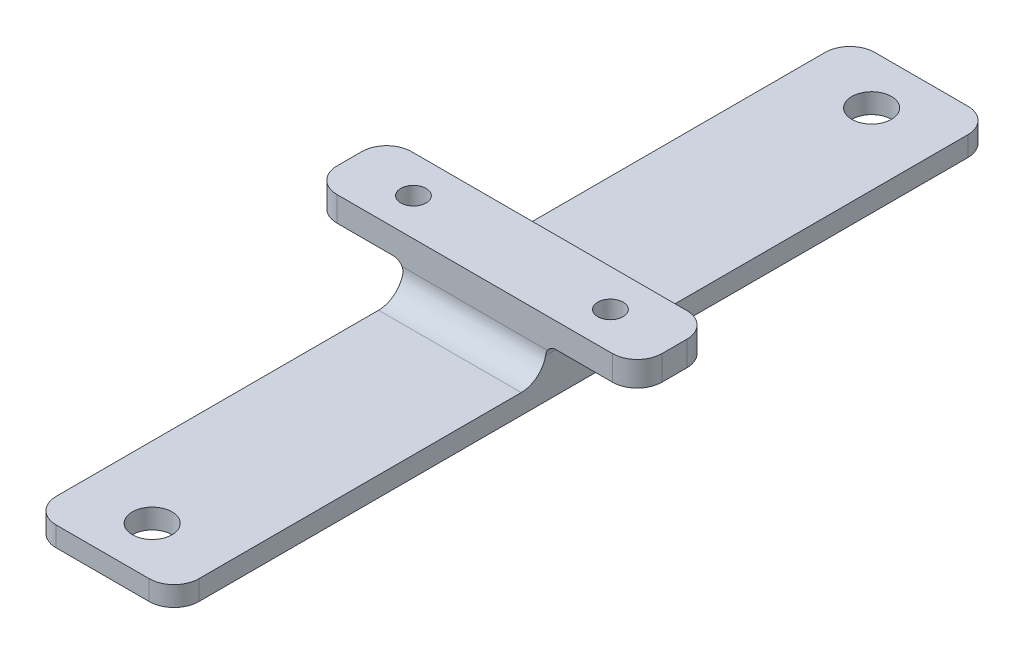
ISO-10303-21;
HEADER;
FILE_DESCRIPTION(('STEP AP214'),'2;1');
FILE_NAME('part.step','',(''),(''),'','','');
FILE_SCHEMA(('AUTOMOTIVE_DESIGN { 1 0 10303 214 1 1 1 1 }'));
ENDSEC;
DATA;
#1=APPLICATION_CONTEXT('core data for automotive mechanical design processes');
#2=APPLICATION_PROTOCOL_DEFINITION('international standard','automotive_design',2000,#1);
#3=PRODUCT_CONTEXT('',#1,'mechanical');
#4=PRODUCT('Part','Part','',(#3));
#5=PRODUCT_RELATED_PRODUCT_CATEGORY('part','',(#4));
#6=PRODUCT_DEFINITION_FORMATION('','',#4);
#7=PRODUCT_DEFINITION_CONTEXT('part definition',#1,'design');
#8=PRODUCT_DEFINITION('design','',#6,#7);
#9=PRODUCT_DEFINITION_SHAPE('','',#8);
#10=(LENGTH_UNIT() NAMED_UNIT(*) SI_UNIT(.MILLI.,.METRE.));
#11=(NAMED_UNIT(*) PLANE_ANGLE_UNIT() SI_UNIT($,.RADIAN.));
#12=(NAMED_UNIT(*) SI_UNIT($,.STERADIAN.) SOLID_ANGLE_UNIT());
#13=UNCERTAINTY_MEASURE_WITH_UNIT(LENGTH_MEASURE(1.E-05),#10,'distance_accuracy_value','');
#14=(GEOMETRIC_REPRESENTATION_CONTEXT(3) GLOBAL_UNCERTAINTY_ASSIGNED_CONTEXT((#13)) GLOBAL_UNIT_ASSIGNED_CONTEXT((#10,
#11,#12)) REPRESENTATION_CONTEXT('',''));
#15=CARTESIAN_POINT('',(0.,0.,0.));
#16=DIRECTION('',(0.,0.,1.));
#17=DIRECTION('',(1.,0.,0.));
#18=AXIS2_PLACEMENT_3D('',#15,#16,#17);
#19=CARTESIAN_POINT('',(0.,1406.6615884136,3.78943290488197E-12));
#20=DIRECTION('',(0.,1.,0.));
#21=DIRECTION('',(0.,0.,1.));
#22=AXIS2_PLACEMENT_3D('',#19,#20,#21);
#23=PLANE('',#22);
#24=DIRECTION('',(0.,0.,-1.));
#25=VECTOR('',#24,1.);
#26=CARTESIAN_POINT('',(912.371288414715,1406.6615884136,281.061912067685));
#27=LINE('',#26,#25);
#28=CARTESIAN_POINT('',(912.371288414715,1406.6615884136,276.061912067685));
#29=VERTEX_POINT('',#28);
#30=CARTESIAN_POINT('',(912.371288414715,1406.6615884136,211.09354746986));
#31=VERTEX_POINT('',#30);
#32=EDGE_CURVE('E443',#29,#31,#27,.T.);
#33=ORIENTED_EDGE('',*,*,#32,.T.);
#34=DIRECTION('',(1.,0.,0.));
#35=VECTOR('',#34,1.);
#36=CARTESIAN_POINT('',(4.07584203045429E-13,1406.6615884136,211.093547469862));
#37=LINE('',#36,#35);
#38=CARTESIAN_POINT('',(883.621288414715,1406.6615884136,211.09354746986));
#39=VERTEX_POINT('',#38);
#40=EDGE_CURVE('E233',#31,#39,#37,.F.);
#41=ORIENTED_EDGE('',*,*,#40,.T.);
#42=DIRECTION('',(0.,0.,1.));
#43=VECTOR('',#42,1.);
#44=CARTESIAN_POINT('',(883.621288414715,1406.6615884136,281.061912067685));
#45=LINE('',#44,#43);
#46=CARTESIAN_POINT('',(883.621288414715,1406.6615884136,276.061912067685));
#47=VERTEX_POINT('',#46);
#48=EDGE_CURVE('E448',#39,#47,#45,.T.);
#49=ORIENTED_EDGE('',*,*,#48,.T.);
#50=CARTESIAN_POINT('',(888.621288414715,1406.6615884136,276.061912067685));
#51=DIRECTION('',(0.,1.,0.));
#52=DIRECTION('',(0.,0.,1.));
#53=AXIS2_PLACEMENT_3D('',#50,#51,#52);
#54=CIRCLE('',#53,5.);
#55=CARTESIAN_POINT('',(888.621288414715,1406.6615884136,281.061912067685));
#56=VERTEX_POINT('',#55);
#57=EDGE_CURVE('E223',#47,#56,#54,.T.);
#58=ORIENTED_EDGE('',*,*,#57,.T.);
#59=DIRECTION('',(1.,0.,0.));
#60=VECTOR('',#59,1.);
#61=CARTESIAN_POINT('',(912.371288414715,1406.6615884136,281.061912067685));
#62=LINE('',#61,#60);
#63=CARTESIAN_POINT('',(907.371288414715,1406.6615884136,281.061912067685));
#64=VERTEX_POINT('',#63);
#65=EDGE_CURVE('E226',#56,#64,#62,.T.);
#66=ORIENTED_EDGE('',*,*,#65,.T.);
#67=CARTESIAN_POINT('',(907.371288414715,1406.6615884136,276.061912067685));
#68=DIRECTION('',(0.,1.,0.));
#69=DIRECTION('',(0.,0.,1.));
#70=AXIS2_PLACEMENT_3D('',#67,#68,#69);
#71=CIRCLE('',#70,5.);
#72=EDGE_CURVE('E231',#64,#29,#71,.T.);
#73=ORIENTED_EDGE('',*,*,#72,.T.);
#74=EDGE_LOOP('',(#33,#41,#49,#58,#66,#73));
#75=FACE_BOUND('',#74,.T.);
#76=CARTESIAN_POINT('',(897.996288414715,1406.6615884136,271.093547469829));
#77=DIRECTION('',(0.,1.,0.));
#78=DIRECTION('',(0.,0.,1.));
#79=AXIS2_PLACEMENT_3D('',#76,#77,#78);
#80=CIRCLE('',#79,3.99999999999999);
#81=CARTESIAN_POINT('',(897.996288414715,1406.6615884136,275.093547469829));
#82=VERTEX_POINT('',#81);
#83=EDGE_CURVE('E428',#82,#82,#80,.T.);
#84=ORIENTED_EDGE('',*,*,#83,.F.);
#85=EDGE_LOOP('',(#84));
#86=FACE_BOUND('',#85,.T.);
#87=ADVANCED_FACE('F33',(#75,#86),#23,.T.);
#88=CARTESIAN_POINT('',(883.621288414715,1406.6615884136,121.093547469829));
#89=VERTEX_POINT('',#88);
#90=CARTESIAN_POINT('',(883.621288414715,1406.6615884136,186.09354746986));
#91=VERTEX_POINT('',#90);
#92=EDGE_CURVE('E449',#89,#91,#45,.T.);
#93=ORIENTED_EDGE('',*,*,#92,.T.);
#94=DIRECTION('',(-1.,0.,0.));
#95=VECTOR('',#94,1.);
#96=CARTESIAN_POINT('',(0.,1406.6615884136,186.09354746986));
#97=LINE('',#96,#95);
#98=CARTESIAN_POINT('',(912.371288414715,1406.6615884136,186.09354746986));
#99=VERTEX_POINT('',#98);
#100=EDGE_CURVE('E245',#91,#99,#97,.F.);
#101=ORIENTED_EDGE('',*,*,#100,.T.);
#102=CARTESIAN_POINT('',(912.371288414715,1406.6615884136,121.093547469829));
#103=VERTEX_POINT('',#102);
#104=EDGE_CURVE('E440',#99,#103,#27,.T.);
#105=ORIENTED_EDGE('',*,*,#104,.T.);
#106=CARTESIAN_POINT('',(907.371288414715,1406.6615884136,121.093547469829));
#107=DIRECTION('',(0.,1.,0.));
#108=DIRECTION('',(0.,0.,1.));
#109=AXIS2_PLACEMENT_3D('',#106,#107,#108);
#110=CIRCLE('',#109,5.);
#111=CARTESIAN_POINT('',(907.371288414715,1406.6615884136,116.093547469829));
#112=VERTEX_POINT('',#111);
#113=EDGE_CURVE('E243',#103,#112,#110,.T.);
#114=ORIENTED_EDGE('',*,*,#113,.T.);
#115=DIRECTION('',(-1.,0.,0.));
#116=VECTOR('',#115,1.);
#117=CARTESIAN_POINT('',(912.371288414715,1406.6615884136,116.093547469829));
#118=LINE('',#117,#116);
#119=CARTESIAN_POINT('',(888.621288414715,1406.6615884136,116.093547469829));
#120=VERTEX_POINT('',#119);
#121=EDGE_CURVE('E445',#112,#120,#118,.T.);
#122=ORIENTED_EDGE('',*,*,#121,.T.);
#123=CARTESIAN_POINT('',(888.621288414715,1406.6615884136,121.093547469829));
#124=DIRECTION('',(0.,1.,0.));
#125=DIRECTION('',(0.,0.,1.));
#126=AXIS2_PLACEMENT_3D('',#123,#124,#125);
#127=CIRCLE('',#126,5.);
#128=EDGE_CURVE('E241',#120,#89,#127,.T.);
#129=ORIENTED_EDGE('',*,*,#128,.T.);
#130=EDGE_LOOP('',(#93,#101,#105,#114,#122,#129));
#131=FACE_BOUND('',#130,.T.);
#132=CARTESIAN_POINT('',(897.996288414715,1406.6615884136,126.093547469829));
#133=DIRECTION('',(0.,1.,0.));
#134=DIRECTION('',(0.,0.,1.));
#135=AXIS2_PLACEMENT_3D('',#132,#133,#134);
#136=CIRCLE('',#135,3.99999999999988);
#137=CARTESIAN_POINT('',(897.996288414715,1406.6615884136,130.093547469829));
#138=VERTEX_POINT('',#137);
#139=EDGE_CURVE('E434',#138,#138,#136,.T.);
#140=ORIENTED_EDGE('',*,*,#139,.F.);
#141=EDGE_LOOP('',(#140));
#142=FACE_BOUND('',#141,.T.);
#143=ADVANCED_FACE('F484',(#131,#142),#23,.T.);
#144=CARTESIAN_POINT('',(0.,1402.6615884136,3.77591714632132E-12));
#145=DIRECTION('',(0.,1.,0.));
#146=DIRECTION('',(0.,0.,1.));
#147=AXIS2_PLACEMENT_3D('',#144,#145,#146);
#148=PLANE('',#147);
#149=DIRECTION('',(0.,0.,-1.));
#150=VECTOR('',#149,1.);
#151=CARTESIAN_POINT('',(912.371288414715,1402.6615884136,281.061912067685));
#152=LINE('',#151,#150);
#153=CARTESIAN_POINT('',(912.371288414715,1402.6615884136,276.061912067685));
#154=VERTEX_POINT('',#153);
#155=CARTESIAN_POINT('',(912.371288414715,1402.6615884136,121.093547469829));
#156=VERTEX_POINT('',#155);
#157=EDGE_CURVE('E437',#154,#156,#152,.T.);
#158=ORIENTED_EDGE('',*,*,#157,.F.);
#159=CARTESIAN_POINT('',(907.371288414715,1402.6615884136,276.061912067685));
#160=DIRECTION('',(0.,1.,0.));
#161=DIRECTION('',(0.,0.,1.));
#162=AXIS2_PLACEMENT_3D('',#159,#160,#161);
#163=CIRCLE('',#162,5.);
#164=CARTESIAN_POINT('',(907.371288414715,1402.6615884136,281.061912067685));
#165=VERTEX_POINT('',#164);
#166=EDGE_CURVE('E258',#154,#165,#163,.F.);
#167=ORIENTED_EDGE('',*,*,#166,.T.);
#168=DIRECTION('',(1.,0.,0.));
#169=VECTOR('',#168,1.);
#170=CARTESIAN_POINT('',(912.371288414715,1402.6615884136,281.061912067685));
#171=LINE('',#170,#169);
#172=CARTESIAN_POINT('',(888.621288414715,1402.6615884136,281.061912067685));
#173=VERTEX_POINT('',#172);
#174=EDGE_CURVE('E444',#173,#165,#171,.T.);
#175=ORIENTED_EDGE('',*,*,#174,.F.);
#176=CARTESIAN_POINT('',(888.621288414715,1402.6615884136,276.061912067685));
#177=DIRECTION('',(0.,1.,0.));
#178=DIRECTION('',(0.,0.,1.));
#179=AXIS2_PLACEMENT_3D('',#176,#177,#178);
#180=CIRCLE('',#179,5.);
#181=CARTESIAN_POINT('',(883.621288414715,1402.6615884136,276.061912067685));
#182=VERTEX_POINT('',#181);
#183=EDGE_CURVE('E256',#173,#182,#180,.F.);
#184=ORIENTED_EDGE('',*,*,#183,.T.);
#185=DIRECTION('',(0.,0.,1.));
#186=VECTOR('',#185,1.);
#187=CARTESIAN_POINT('',(883.621288414715,1402.6615884136,281.061912067685));
#188=LINE('',#187,#186);
#189=CARTESIAN_POINT('',(883.621288414715,1402.6615884136,121.093547469829));
#190=VERTEX_POINT('',#189);
#191=EDGE_CURVE('E459',#190,#182,#188,.T.);
#192=ORIENTED_EDGE('',*,*,#191,.F.);
#193=CARTESIAN_POINT('',(888.621288414715,1402.6615884136,121.093547469829));
#194=DIRECTION('',(0.,1.,0.));
#195=DIRECTION('',(0.,0.,1.));
#196=AXIS2_PLACEMENT_3D('',#193,#194,#195);
#197=CIRCLE('',#196,5.);
#198=CARTESIAN_POINT('',(888.621288414715,1402.6615884136,116.093547469829));
#199=VERTEX_POINT('',#198);
#200=EDGE_CURVE('E252',#190,#199,#197,.F.);
#201=ORIENTED_EDGE('',*,*,#200,.T.);
#202=DIRECTION('',(-1.,0.,0.));
#203=VECTOR('',#202,1.);
#204=CARTESIAN_POINT('',(912.371288414715,1402.6615884136,116.093547469829));
#205=LINE('',#204,#203);
#206=CARTESIAN_POINT('',(907.371288414715,1402.6615884136,116.093547469829));
#207=VERTEX_POINT('',#206);
#208=EDGE_CURVE('E456',#207,#199,#205,.T.);
#209=ORIENTED_EDGE('',*,*,#208,.F.);
#210=CARTESIAN_POINT('',(907.371288414715,1402.6615884136,121.093547469829));
#211=DIRECTION('',(0.,1.,0.));
#212=DIRECTION('',(0.,0.,1.));
#213=AXIS2_PLACEMENT_3D('',#210,#211,#212);
#214=CIRCLE('',#213,5.);
#215=EDGE_CURVE('E254',#207,#156,#214,.F.);
#216=ORIENTED_EDGE('',*,*,#215,.T.);
#217=EDGE_LOOP('',(#158,#167,#175,#184,#192,#201,#209,#216));
#218=FACE_BOUND('',#217,.T.);
#219=CARTESIAN_POINT('',(897.996288414715,1402.6615884136,126.093547469829));
#220=DIRECTION('',(0.,1.,0.));
#221=DIRECTION('',(0.,0.,1.));
#222=AXIS2_PLACEMENT_3D('',#219,#220,#221);
#223=CIRCLE('',#222,3.99999999999988);
#224=CARTESIAN_POINT('',(897.996288414715,1402.6615884136,130.093547469829));
#225=VERTEX_POINT('',#224);
#226=EDGE_CURVE('E431',#225,#225,#223,.T.);
#227=ORIENTED_EDGE('',*,*,#226,.T.);
#228=EDGE_LOOP('',(#227));
#229=FACE_BOUND('',#228,.T.);
#230=CARTESIAN_POINT('',(897.996288414715,1402.6615884136,271.093547469829));
#231=DIRECTION('',(0.,1.,0.));
#232=DIRECTION('',(0.,0.,1.));
#233=AXIS2_PLACEMENT_3D('',#230,#231,#232);
#234=CIRCLE('',#233,3.99999999999999);
#235=CARTESIAN_POINT('',(897.996288414715,1402.6615884136,275.093547469829));
#236=VERTEX_POINT('',#235);
#237=EDGE_CURVE('E424',#236,#236,#234,.T.);
#238=ORIENTED_EDGE('',*,*,#237,.T.);
#239=EDGE_LOOP('',(#238));
#240=FACE_BOUND('',#239,.T.);
#241=ADVANCED_FACE('F545',(#218,#229,#240),#148,.F.);
#242=CARTESIAN_POINT('',(912.371288414715,1406.6615884136,281.061912067685));
#243=DIRECTION('',(-1.,0.,0.));
#244=DIRECTION('',(0.,-1.,0.));
#245=AXIS2_PLACEMENT_3D('',#242,#243,#244);
#246=PLANE('',#245);
#247=CARTESIAN_POINT('',(912.371288414715,1411.6615884136,186.09354746986));
#248=DIRECTION('',(-1.,0.,0.));
#249=DIRECTION('',(0.,-1.,0.));
#250=AXIS2_PLACEMENT_3D('',#247,#248,#249);
#251=CIRCLE('',#250,5.);
#252=CARTESIAN_POINT('',(912.371288414715,1410.6615884136,190.992526955427));
#253=VERTEX_POINT('',#252);
#254=EDGE_CURVE('E303',#99,#253,#251,.T.);
#255=ORIENTED_EDGE('',*,*,#254,.T.);
#256=DIRECTION('',(0.,0.,-1.));
#257=VECTOR('',#256,1.);
#258=CARTESIAN_POINT('',(912.371288414715,1410.6615884136,206.09354746986));
#259=LINE('',#258,#257);
#260=CARTESIAN_POINT('',(912.371288414715,1410.6615884136,206.194567984294));
#261=VERTEX_POINT('',#260);
#262=EDGE_CURVE('E313',#253,#261,#259,.F.);
#263=ORIENTED_EDGE('',*,*,#262,.T.);
#264=CARTESIAN_POINT('',(912.371288414715,1411.6615884136,211.09354746986));
#265=DIRECTION('',(-1.,0.,0.));
#266=DIRECTION('',(0.,-1.,0.));
#267=AXIS2_PLACEMENT_3D('',#264,#265,#266);
#268=CIRCLE('',#267,5.);
#269=EDGE_CURVE('E296',#261,#31,#268,.T.);
#270=ORIENTED_EDGE('',*,*,#269,.T.);
#271=ORIENTED_EDGE('',*,*,#32,.F.);
#272=DIRECTION('',(0.,-1.,0.));
#273=VECTOR('',#272,1.);
#274=CARTESIAN_POINT('',(912.371288414715,1406.6615884136,276.061912067685));
#275=LINE('',#274,#273);
#276=EDGE_CURVE('E249',#29,#154,#275,.T.);
#277=ORIENTED_EDGE('',*,*,#276,.T.);
#278=ORIENTED_EDGE('',*,*,#157,.T.);
#279=DIRECTION('',(0.,-1.,0.));
#280=VECTOR('',#279,1.);
#281=CARTESIAN_POINT('',(912.371288414715,1406.6615884136,121.093547469829));
#282=LINE('',#281,#280);
#283=EDGE_CURVE('E247',#156,#103,#282,.F.);
#284=ORIENTED_EDGE('',*,*,#283,.T.);
#285=ORIENTED_EDGE('',*,*,#104,.F.);
#286=EDGE_LOOP('',(#255,#263,#270,#271,#277,#278,#284,#285));
#287=FACE_BOUND('',#286,.T.);
#288=ADVANCED_FACE('F476',(#287),#246,.F.);
#289=CARTESIAN_POINT('',(912.371288414715,1406.6615884136,116.093547469829));
#290=DIRECTION('',(0.,0.,1.));
#291=DIRECTION('',(0.,-1.,0.));
#292=AXIS2_PLACEMENT_3D('',#289,#290,#291);
#293=PLANE('',#292);
#294=ORIENTED_EDGE('',*,*,#121,.F.);
#295=DIRECTION('',(0.,-1.,0.));
#296=VECTOR('',#295,1.);
#297=CARTESIAN_POINT('',(907.371288414715,1406.6615884136,116.093547469829));
#298=LINE('',#297,#296);
#299=EDGE_CURVE('E293',#112,#207,#298,.T.);
#300=ORIENTED_EDGE('',*,*,#299,.T.);
#301=ORIENTED_EDGE('',*,*,#208,.T.);
#302=DIRECTION('',(0.,-1.,0.));
#303=VECTOR('',#302,1.);
#304=CARTESIAN_POINT('',(888.621288414715,1406.6615884136,116.093547469829));
#305=LINE('',#304,#303);
#306=EDGE_CURVE('E291',#199,#120,#305,.F.);
#307=ORIENTED_EDGE('',*,*,#306,.T.);
#308=EDGE_LOOP('',(#294,#300,#301,#307));
#309=FACE_BOUND('',#308,.T.);
#310=ADVANCED_FACE('F493',(#309),#293,.F.);
#311=CARTESIAN_POINT('',(883.621288414715,1406.6615884136,281.061912067685));
#312=DIRECTION('',(1.,0.,0.));
#313=DIRECTION('',(0.,1.,0.));
#314=AXIS2_PLACEMENT_3D('',#311,#312,#313);
#315=PLANE('',#314);
#316=CARTESIAN_POINT('',(883.621288414715,1411.6615884136,211.09354746986));
#317=DIRECTION('',(1.,0.,0.));
#318=DIRECTION('',(0.,1.,0.));
#319=AXIS2_PLACEMENT_3D('',#316,#317,#318);
#320=CIRCLE('',#319,5.);
#321=CARTESIAN_POINT('',(883.621288414715,1410.6615884136,206.194567984294));
#322=VERTEX_POINT('',#321);
#323=EDGE_CURVE('E298',#39,#322,#320,.T.);
#324=ORIENTED_EDGE('',*,*,#323,.T.);
#325=DIRECTION('',(0.,0.,1.));
#326=VECTOR('',#325,1.);
#327=CARTESIAN_POINT('',(883.621288414715,1410.6615884136,191.09354746986));
#328=LINE('',#327,#326);
#329=CARTESIAN_POINT('',(883.621288414715,1410.6615884136,190.992526955427));
#330=VERTEX_POINT('',#329);
#331=EDGE_CURVE('E309',#322,#330,#328,.F.);
#332=ORIENTED_EDGE('',*,*,#331,.T.);
#333=CARTESIAN_POINT('',(883.621288414715,1411.6615884136,186.09354746986));
#334=DIRECTION('',(1.,0.,0.));
#335=DIRECTION('',(0.,1.,0.));
#336=AXIS2_PLACEMENT_3D('',#333,#334,#335);
#337=CIRCLE('',#336,5.);
#338=EDGE_CURVE('E301',#330,#91,#337,.T.);
#339=ORIENTED_EDGE('',*,*,#338,.T.);
#340=ORIENTED_EDGE('',*,*,#92,.F.);
#341=DIRECTION('',(0.,-1.,0.));
#342=VECTOR('',#341,1.);
#343=CARTESIAN_POINT('',(883.621288414715,1406.6615884136,121.093547469829));
#344=LINE('',#343,#342);
#345=EDGE_CURVE('E265',#89,#190,#344,.T.);
#346=ORIENTED_EDGE('',*,*,#345,.T.);
#347=ORIENTED_EDGE('',*,*,#191,.T.);
#348=DIRECTION('',(0.,-1.,0.));
#349=VECTOR('',#348,1.);
#350=CARTESIAN_POINT('',(883.621288414715,1406.6615884136,276.061912067685));
#351=LINE('',#350,#349);
#352=EDGE_CURVE('E216',#182,#47,#351,.F.);
#353=ORIENTED_EDGE('',*,*,#352,.T.);
#354=ORIENTED_EDGE('',*,*,#48,.F.);
#355=EDGE_LOOP('',(#324,#332,#339,#340,#346,#347,#353,#354));
#356=FACE_BOUND('',#355,.T.);
#357=ADVANCED_FACE('F498',(#356),#315,.F.);
#358=CARTESIAN_POINT('',(912.371288414715,1406.6615884136,281.061912067685));
#359=DIRECTION('',(0.,0.,-1.));
#360=DIRECTION('',(0.,1.,0.));
#361=AXIS2_PLACEMENT_3D('',#358,#359,#360);
#362=PLANE('',#361);
#363=ORIENTED_EDGE('',*,*,#174,.T.);
#364=DIRECTION('',(0.,-1.,0.));
#365=VECTOR('',#364,1.);
#366=CARTESIAN_POINT('',(907.371288414715,1406.6615884136,281.061912067685));
#367=LINE('',#366,#365);
#368=EDGE_CURVE('E263',#165,#64,#367,.F.);
#369=ORIENTED_EDGE('',*,*,#368,.T.);
#370=ORIENTED_EDGE('',*,*,#65,.F.);
#371=DIRECTION('',(0.,-1.,0.));
#372=VECTOR('',#371,1.);
#373=CARTESIAN_POINT('',(888.621288414715,1406.6615884136,281.061912067685));
#374=LINE('',#373,#372);
#375=EDGE_CURVE('E260',#56,#173,#374,.T.);
#376=ORIENTED_EDGE('',*,*,#375,.T.);
#377=EDGE_LOOP('',(#363,#369,#370,#376));
#378=FACE_BOUND('',#377,.T.);
#379=ADVANCED_FACE('F465',(#378),#362,.F.);
#380=CARTESIAN_POINT('',(897.996288414715,1406.6615884136,126.093547469829));
#381=DIRECTION('',(0.,-1.,0.));
#382=DIRECTION('',(0.,0.,-1.));
#383=AXIS2_PLACEMENT_3D('',#380,#381,#382);
#384=CYLINDRICAL_SURFACE('',#383,3.99999999999988);
#385=ORIENTED_EDGE('',*,*,#139,.T.);
#386=EDGE_LOOP('',(#385));
#387=FACE_BOUND('',#386,.T.);
#388=ORIENTED_EDGE('',*,*,#226,.F.);
#389=EDGE_LOOP('',(#388));
#390=FACE_BOUND('',#389,.T.);
#391=ADVANCED_FACE('F548',(#387,#390),#384,.F.);
#392=CARTESIAN_POINT('',(897.996288414715,1406.6615884136,271.093547469829));
#393=DIRECTION('',(0.,-1.,0.));
#394=DIRECTION('',(0.,0.,-1.));
#395=AXIS2_PLACEMENT_3D('',#392,#393,#394);
#396=CYLINDRICAL_SURFACE('',#395,3.99999999999999);
#397=ORIENTED_EDGE('',*,*,#83,.T.);
#398=EDGE_LOOP('',(#397));
#399=FACE_BOUND('',#398,.T.);
#400=ORIENTED_EDGE('',*,*,#237,.F.);
#401=EDGE_LOOP('',(#400));
#402=FACE_BOUND('',#401,.T.);
#403=ADVANCED_FACE('F582',(#399,#402),#396,.F.);
#404=CARTESIAN_POINT('',(883.621288414749,1412.6615884136,191.09354746986));
#405=DIRECTION('',(0.,0.,1.));
#406=DIRECTION('',(0.,-1.,0.));
#407=AXIS2_PLACEMENT_3D('',#404,#405,#406);
#408=PLANE('',#407);
#409=DIRECTION('',(-1.,0.,0.));
#410=VECTOR('',#409,1.);
#411=CARTESIAN_POINT('',(865.246288414732,1412.6615884136,191.09354746986));
#412=LINE('',#411,#410);
#413=CARTESIAN_POINT('',(925.746288414732,1412.6615884136,191.09354746986));
#414=VERTEX_POINT('',#413);
#415=CARTESIAN_POINT('',(914.371288414715,1412.6615884136,191.09354746986));
#416=VERTEX_POINT('',#415);
#417=EDGE_CURVE('E395',#414,#416,#412,.T.);
#418=ORIENTED_EDGE('',*,*,#417,.T.);
#419=CARTESIAN_POINT('',(914.371288414715,1410.6615884136,191.09354746986));
#420=DIRECTION('',(0.,0.,1.));
#421=DIRECTION('',(0.,-1.,0.));
#422=AXIS2_PLACEMENT_3D('',#419,#420,#421);
#423=CIRCLE('',#422,2.);
#424=CARTESIAN_POINT('',(912.639237607146,1411.6615884136,191.09354746986));
#425=VERTEX_POINT('',#424);
#426=EDGE_CURVE('E380',#416,#425,#423,.T.);
#427=ORIENTED_EDGE('',*,*,#426,.T.);
#428=DIRECTION('',(-1.,0.,0.));
#429=VECTOR('',#428,1.);
#430=CARTESIAN_POINT('',(883.621288414749,1411.6615884136,191.09354746986));
#431=LINE('',#430,#429);
#432=CARTESIAN_POINT('',(883.353339222284,1411.6615884136,191.09354746986));
#433=VERTEX_POINT('',#432);
#434=EDGE_CURVE('E56',#425,#433,#431,.T.);
#435=ORIENTED_EDGE('',*,*,#434,.T.);
#436=CARTESIAN_POINT('',(881.621288414715,1410.6615884136,191.09354746986));
#437=DIRECTION('',(0.,0.,1.));
#438=DIRECTION('',(0.,-1.,0.));
#439=AXIS2_PLACEMENT_3D('',#436,#437,#438);
#440=CIRCLE('',#439,2.);
#441=CARTESIAN_POINT('',(881.621288414715,1412.6615884136,191.09354746986));
#442=VERTEX_POINT('',#441);
#443=EDGE_CURVE('E505',#433,#442,#440,.T.);
#444=ORIENTED_EDGE('',*,*,#443,.T.);
#445=CARTESIAN_POINT('',(870.246288414732,1412.6615884136,191.09354746986));
#446=VERTEX_POINT('',#445);
#447=EDGE_CURVE('E401',#442,#446,#412,.T.);
#448=ORIENTED_EDGE('',*,*,#447,.T.);
#449=DIRECTION('',(0.,-1.,0.));
#450=VECTOR('',#449,1.);
#451=CARTESIAN_POINT('',(870.246288414732,1412.6615884136,191.09354746986));
#452=LINE('',#451,#450);
#453=CARTESIAN_POINT('',(870.246288414732,1417.66158841359,191.09354746986));
#454=VERTEX_POINT('',#453);
#455=EDGE_CURVE('E235',#446,#454,#452,.F.);
#456=ORIENTED_EDGE('',*,*,#455,.T.);
#457=DIRECTION('',(1.,0.,0.));
#458=VECTOR('',#457,1.);
#459=CARTESIAN_POINT('',(865.246288414732,1417.66158841359,191.09354746986));
#460=LINE('',#459,#458);
#461=CARTESIAN_POINT('',(925.746288414732,1417.66158841359,191.09354746986));
#462=VERTEX_POINT('',#461);
#463=EDGE_CURVE('E406',#454,#462,#460,.T.);
#464=ORIENTED_EDGE('',*,*,#463,.T.);
#465=DIRECTION('',(0.,-1.,0.));
#466=VECTOR('',#465,1.);
#467=CARTESIAN_POINT('',(925.746288414732,1412.6615884136,191.09354746986));
#468=LINE('',#467,#466);
#469=EDGE_CURVE('E237',#462,#414,#468,.T.);
#470=ORIENTED_EDGE('',*,*,#469,.T.);
#471=EDGE_LOOP('',(#418,#427,#435,#444,#448,#456,#464,#470));
#472=FACE_BOUND('',#471,.T.);
#473=ADVANCED_FACE('F397',(#472),#408,.F.);
#474=CARTESIAN_POINT('',(883.621288414749,1412.6615884136,206.09354746986));
#475=DIRECTION('',(0.,0.,-1.));
#476=DIRECTION('',(0.,1.,0.));
#477=AXIS2_PLACEMENT_3D('',#474,#475,#476);
#478=PLANE('',#477);
#479=DIRECTION('',(1.,0.,0.));
#480=VECTOR('',#479,1.);
#481=CARTESIAN_POINT('',(865.246288414732,1412.6615884136,206.09354746986));
#482=LINE('',#481,#480);
#483=CARTESIAN_POINT('',(870.246288414732,1412.6615884136,206.09354746986));
#484=VERTEX_POINT('',#483);
#485=CARTESIAN_POINT('',(881.621288414715,1412.6615884136,206.09354746986));
#486=VERTEX_POINT('',#485);
#487=EDGE_CURVE('E204',#484,#486,#482,.T.);
#488=ORIENTED_EDGE('',*,*,#487,.T.);
#489=CARTESIAN_POINT('',(881.621288414715,1410.6615884136,206.09354746986));
#490=DIRECTION('',(0.,0.,-1.));
#491=DIRECTION('',(0.,1.,0.));
#492=AXIS2_PLACEMENT_3D('',#489,#490,#491);
#493=CIRCLE('',#492,2.);
#494=CARTESIAN_POINT('',(883.353339222284,1411.6615884136,206.09354746986));
#495=VERTEX_POINT('',#494);
#496=EDGE_CURVE('E315',#486,#495,#493,.T.);
#497=ORIENTED_EDGE('',*,*,#496,.T.);
#498=DIRECTION('',(1.,0.,0.));
#499=VECTOR('',#498,1.);
#500=CARTESIAN_POINT('',(883.621288414749,1411.6615884136,206.09354746986));
#501=LINE('',#500,#499);
#502=CARTESIAN_POINT('',(912.639237607145,1411.6615884136,206.09354746986));
#503=VERTEX_POINT('',#502);
#504=EDGE_CURVE('E48',#495,#503,#501,.T.);
#505=ORIENTED_EDGE('',*,*,#504,.T.);
#506=CARTESIAN_POINT('',(914.371288414715,1410.6615884136,206.09354746986));
#507=DIRECTION('',(0.,0.,-1.));
#508=DIRECTION('',(0.,1.,0.));
#509=AXIS2_PLACEMENT_3D('',#506,#507,#508);
#510=CIRCLE('',#509,2.);
#511=CARTESIAN_POINT('',(914.371288414715,1412.6615884136,206.09354746986));
#512=VERTEX_POINT('',#511);
#513=EDGE_CURVE('E11',#503,#512,#510,.T.);
#514=ORIENTED_EDGE('',*,*,#513,.T.);
#515=CARTESIAN_POINT('',(925.746288414732,1412.6615884136,206.09354746986));
#516=VERTEX_POINT('',#515);
#517=EDGE_CURVE('E192',#512,#516,#482,.T.);
#518=ORIENTED_EDGE('',*,*,#517,.T.);
#519=DIRECTION('',(0.,-1.,0.));
#520=VECTOR('',#519,1.);
#521=CARTESIAN_POINT('',(925.746288414732,1412.6615884136,206.09354746986));
#522=LINE('',#521,#520);
#523=CARTESIAN_POINT('',(925.746288414732,1417.66158841359,206.09354746986));
#524=VERTEX_POINT('',#523);
#525=EDGE_CURVE('E198',#516,#524,#522,.F.);
#526=ORIENTED_EDGE('',*,*,#525,.T.);
#527=DIRECTION('',(-1.,0.,0.));
#528=VECTOR('',#527,1.);
#529=CARTESIAN_POINT('',(865.246288414732,1417.66158841359,206.09354746986));
#530=LINE('',#529,#528);
#531=CARTESIAN_POINT('',(870.246288414732,1417.66158841359,206.09354746986));
#532=VERTEX_POINT('',#531);
#533=EDGE_CURVE('E205',#524,#532,#530,.T.);
#534=ORIENTED_EDGE('',*,*,#533,.T.);
#535=DIRECTION('',(0.,-1.,0.));
#536=VECTOR('',#535,1.);
#537=CARTESIAN_POINT('',(870.246288414732,1412.6615884136,206.09354746986));
#538=LINE('',#537,#536);
#539=EDGE_CURVE('E221',#532,#484,#538,.T.);
#540=ORIENTED_EDGE('',*,*,#539,.T.);
#541=EDGE_LOOP('',(#488,#497,#505,#514,#518,#526,#534,#540));
#542=FACE_BOUND('',#541,.T.);
#543=ADVANCED_FACE('F195',(#542),#478,.F.);
#544=CARTESIAN_POINT('',(0.,1412.6615884136,0.));
#545=DIRECTION('',(0.,1.,0.));
#546=DIRECTION('',(0.,0.,1.));
#547=AXIS2_PLACEMENT_3D('',#544,#545,#546);
#548=PLANE('',#547);
#549=CARTESIAN_POINT('',(917.846288414732,1412.6615884136,198.59354746986));
#550=DIRECTION('',(0.,1.,0.));
#551=DIRECTION('',(0.,0.,1.));
#552=AXIS2_PLACEMENT_3D('',#549,#550,#551);
#553=CIRCLE('',#552,2.55000000000005);
#554=CARTESIAN_POINT('',(917.846288414732,1412.6615884136,201.14354746986));
#555=VERTEX_POINT('',#554);
#556=EDGE_CURVE('E411',#555,#555,#553,.T.);
#557=ORIENTED_EDGE('',*,*,#556,.T.);
#558=EDGE_LOOP('',(#557));
#559=FACE_BOUND('',#558,.T.);
#560=ORIENTED_EDGE('',*,*,#517,.F.);
#561=DIRECTION('',(0.,0.,-1.));
#562=VECTOR('',#561,1.);
#563=CARTESIAN_POINT('',(914.371288414715,1412.6615884136,191.09354746986));
#564=LINE('',#563,#562);
#565=EDGE_CURVE('E311',#512,#416,#564,.T.);
#566=ORIENTED_EDGE('',*,*,#565,.T.);
#567=ORIENTED_EDGE('',*,*,#417,.F.);
#568=CARTESIAN_POINT('',(925.746288414732,1412.6615884136,196.09354746986));
#569=DIRECTION('',(0.,1.,0.));
#570=DIRECTION('',(0.,0.,1.));
#571=AXIS2_PLACEMENT_3D('',#568,#569,#570);
#572=CIRCLE('',#571,5.);
#573=CARTESIAN_POINT('',(930.746288414732,1412.6615884136,196.09354746986));
#574=VERTEX_POINT('',#573);
#575=EDGE_CURVE('E215',#414,#574,#572,.F.);
#576=ORIENTED_EDGE('',*,*,#575,.T.);
#577=DIRECTION('',(0.,0.,-1.));
#578=VECTOR('',#577,1.);
#579=CARTESIAN_POINT('',(930.746288414732,1412.6615884136,191.09354746986));
#580=LINE('',#579,#578);
#581=CARTESIAN_POINT('',(930.746288414732,1412.6615884136,201.09354746986));
#582=VERTEX_POINT('',#581);
#583=EDGE_CURVE('E211',#582,#574,#580,.T.);
#584=ORIENTED_EDGE('',*,*,#583,.F.);
#585=CARTESIAN_POINT('',(925.746288414732,1412.6615884136,201.09354746986));
#586=DIRECTION('',(0.,1.,0.));
#587=DIRECTION('',(0.,0.,1.));
#588=AXIS2_PLACEMENT_3D('',#585,#586,#587);
#589=CIRCLE('',#588,5.);
#590=EDGE_CURVE('E208',#582,#516,#589,.F.);
#591=ORIENTED_EDGE('',*,*,#590,.T.);
#592=EDGE_LOOP('',(#560,#566,#567,#576,#584,#591));
#593=FACE_BOUND('',#592,.T.);
#594=ADVANCED_FACE('F209',(#559,#593),#548,.F.);
#595=CARTESIAN_POINT('',(878.146288414732,1412.6615884136,198.59354746986));
#596=DIRECTION('',(0.,1.,0.));
#597=DIRECTION('',(0.,0.,1.));
#598=AXIS2_PLACEMENT_3D('',#595,#596,#597);
#599=CIRCLE('',#598,2.55000000000004);
#600=CARTESIAN_POINT('',(878.146288414732,1412.6615884136,201.14354746986));
#601=VERTEX_POINT('',#600);
#602=EDGE_CURVE('E414',#601,#601,#599,.T.);
#603=ORIENTED_EDGE('',*,*,#602,.T.);
#604=EDGE_LOOP('',(#603));
#605=FACE_BOUND('',#604,.T.);
#606=ORIENTED_EDGE('',*,*,#447,.F.);
#607=DIRECTION('',(0.,0.,1.));
#608=VECTOR('',#607,1.);
#609=CARTESIAN_POINT('',(881.621288414715,1412.6615884136,206.09354746986));
#610=LINE('',#609,#608);
#611=EDGE_CURVE('E306',#442,#486,#610,.T.);
#612=ORIENTED_EDGE('',*,*,#611,.T.);
#613=ORIENTED_EDGE('',*,*,#487,.F.);
#614=CARTESIAN_POINT('',(870.246288414732,1412.6615884136,201.09354746986));
#615=DIRECTION('',(0.,1.,0.));
#616=DIRECTION('',(0.,0.,1.));
#617=AXIS2_PLACEMENT_3D('',#614,#615,#616);
#618=CIRCLE('',#617,5.);
#619=CARTESIAN_POINT('',(865.246288414732,1412.6615884136,201.09354746986));
#620=VERTEX_POINT('',#619);
#621=EDGE_CURVE('E284',#484,#620,#618,.F.);
#622=ORIENTED_EDGE('',*,*,#621,.T.);
#623=DIRECTION('',(0.,0.,1.));
#624=VECTOR('',#623,1.);
#625=CARTESIAN_POINT('',(865.246288414732,1412.6615884136,191.09354746986));
#626=LINE('',#625,#624);
#627=CARTESIAN_POINT('',(865.246288414732,1412.6615884136,196.09354746986));
#628=VERTEX_POINT('',#627);
#629=EDGE_CURVE('E404',#628,#620,#626,.T.);
#630=ORIENTED_EDGE('',*,*,#629,.F.);
#631=CARTESIAN_POINT('',(870.246288414732,1412.6615884136,196.09354746986));
#632=DIRECTION('',(0.,1.,0.));
#633=DIRECTION('',(0.,0.,1.));
#634=AXIS2_PLACEMENT_3D('',#631,#632,#633);
#635=CIRCLE('',#634,5.);
#636=EDGE_CURVE('E281',#628,#446,#635,.F.);
#637=ORIENTED_EDGE('',*,*,#636,.T.);
#638=EDGE_LOOP('',(#606,#612,#613,#622,#630,#637));
#639=FACE_BOUND('',#638,.T.);
#640=ADVANCED_FACE('F508',(#605,#639),#548,.F.);
#641=CARTESIAN_POINT('',(930.746288414732,1484.85719838924,191.09354746986));
#642=DIRECTION('',(-1.,0.,0.));
#643=DIRECTION('',(0.,0.,1.));
#644=AXIS2_PLACEMENT_3D('',#641,#642,#643);
#645=PLANE('',#644);
#646=ORIENTED_EDGE('',*,*,#583,.T.);
#647=DIRECTION('',(0.,-1.,0.));
#648=VECTOR('',#647,1.);
#649=CARTESIAN_POINT('',(930.746288414732,1484.85719838924,196.09354746986));
#650=LINE('',#649,#648);
#651=CARTESIAN_POINT('',(930.746288414732,1417.66158841359,196.09354746986));
#652=VERTEX_POINT('',#651);
#653=EDGE_CURVE('E272',#574,#652,#650,.F.);
#654=ORIENTED_EDGE('',*,*,#653,.T.);
#655=DIRECTION('',(0.,0.,1.));
#656=VECTOR('',#655,1.);
#657=CARTESIAN_POINT('',(930.746288414732,1417.66158841359,191.093547469859));
#658=LINE('',#657,#656);
#659=CARTESIAN_POINT('',(930.746288414732,1417.66158841359,201.09354746986));
#660=VERTEX_POINT('',#659);
#661=EDGE_CURVE('E410',#652,#660,#658,.T.);
#662=ORIENTED_EDGE('',*,*,#661,.T.);
#663=DIRECTION('',(0.,-1.,0.));
#664=VECTOR('',#663,1.);
#665=CARTESIAN_POINT('',(930.746288414732,1484.85719838924,201.09354746986));
#666=LINE('',#665,#664);
#667=EDGE_CURVE('E270',#660,#582,#666,.T.);
#668=ORIENTED_EDGE('',*,*,#667,.T.);
#669=EDGE_LOOP('',(#646,#654,#662,#668));
#670=FACE_BOUND('',#669,.T.);
#671=ADVANCED_FACE('F528',(#670),#645,.F.);
#672=CARTESIAN_POINT('',(865.246288414732,1484.85719838924,191.09354746986));
#673=DIRECTION('',(1.,0.,0.));
#674=DIRECTION('',(0.,0.,-1.));
#675=AXIS2_PLACEMENT_3D('',#672,#673,#674);
#676=PLANE('',#675);
#677=ORIENTED_EDGE('',*,*,#629,.T.);
#678=DIRECTION('',(0.,-1.,0.));
#679=VECTOR('',#678,1.);
#680=CARTESIAN_POINT('',(865.246288414732,1484.85719838924,201.09354746986));
#681=LINE('',#680,#679);
#682=CARTESIAN_POINT('',(865.246288414732,1417.66158841359,201.09354746986));
#683=VERTEX_POINT('',#682);
#684=EDGE_CURVE('E289',#620,#683,#681,.F.);
#685=ORIENTED_EDGE('',*,*,#684,.T.);
#686=DIRECTION('',(0.,0.,-1.));
#687=VECTOR('',#686,1.);
#688=CARTESIAN_POINT('',(865.246288414732,1417.66158841359,191.093547469859));
#689=LINE('',#688,#687);
#690=CARTESIAN_POINT('',(865.246288414732,1417.66158841359,196.09354746986));
#691=VERTEX_POINT('',#690);
#692=EDGE_CURVE('E400',#683,#691,#689,.T.);
#693=ORIENTED_EDGE('',*,*,#692,.T.);
#694=DIRECTION('',(0.,-1.,0.));
#695=VECTOR('',#694,1.);
#696=CARTESIAN_POINT('',(865.246288414732,1484.85719838924,196.09354746986));
#697=LINE('',#696,#695);
#698=EDGE_CURVE('E286',#691,#628,#697,.T.);
#699=ORIENTED_EDGE('',*,*,#698,.T.);
#700=EDGE_LOOP('',(#677,#685,#693,#699));
#701=FACE_BOUND('',#700,.T.);
#702=ADVANCED_FACE('F516',(#701),#676,.F.);
#703=CARTESIAN_POINT('',(917.846288414732,1484.85719838924,198.59354746986));
#704=DIRECTION('',(0.,-1.,0.));
#705=DIRECTION('',(0.,0.,-1.));
#706=AXIS2_PLACEMENT_3D('',#703,#704,#705);
#707=CYLINDRICAL_SURFACE('',#706,2.55000000000005);
#708=CARTESIAN_POINT('',(917.846288414732,1417.66158841359,198.59354746986));
#709=DIRECTION('',(0.,-1.,0.));
#710=DIRECTION('',(0.,0.,-1.));
#711=AXIS2_PLACEMENT_3D('',#708,#709,#710);
#712=CIRCLE('',#711,2.55000000000005);
#713=CARTESIAN_POINT('',(917.846288414732,1417.66158841359,196.04354746986));
#714=VERTEX_POINT('',#713);
#715=EDGE_CURVE('E421',#714,#714,#712,.T.);
#716=ORIENTED_EDGE('',*,*,#715,.F.);
#717=EDGE_LOOP('',(#716));
#718=FACE_BOUND('',#717,.T.);
#719=ORIENTED_EDGE('',*,*,#556,.F.);
#720=EDGE_LOOP('',(#719));
#721=FACE_BOUND('',#720,.T.);
#722=ADVANCED_FACE('F535',(#718,#721),#707,.F.);
#723=CARTESIAN_POINT('',(878.146288414732,1484.85719838924,198.59354746986));
#724=DIRECTION('',(0.,-1.,0.));
#725=DIRECTION('',(0.,0.,-1.));
#726=AXIS2_PLACEMENT_3D('',#723,#724,#725);
#727=CYLINDRICAL_SURFACE('',#726,2.55000000000004);
#728=CARTESIAN_POINT('',(878.146288414732,1417.66158841359,198.59354746986));
#729=DIRECTION('',(0.,-1.,0.));
#730=DIRECTION('',(0.,0.,-1.));
#731=AXIS2_PLACEMENT_3D('',#728,#729,#730);
#732=CIRCLE('',#731,2.55000000000004);
#733=CARTESIAN_POINT('',(878.146288414732,1417.66158841359,196.04354746986));
#734=VERTEX_POINT('',#733);
#735=EDGE_CURVE('E425',#734,#734,#732,.T.);
#736=ORIENTED_EDGE('',*,*,#735,.F.);
#737=EDGE_LOOP('',(#736));
#738=FACE_BOUND('',#737,.T.);
#739=ORIENTED_EDGE('',*,*,#602,.F.);
#740=EDGE_LOOP('',(#739));
#741=FACE_BOUND('',#740,.T.);
#742=ADVANCED_FACE('F680',(#738,#741),#727,.F.);
#743=CARTESIAN_POINT('',(927.746288414732,1417.66158841359,168.84354746986));
#744=DIRECTION('',(0.,-1.,0.));
#745=DIRECTION('',(0.,0.,1.));
#746=AXIS2_PLACEMENT_3D('',#743,#744,#745);
#747=PLANE('',#746);
#748=ORIENTED_EDGE('',*,*,#735,.T.);
#749=EDGE_LOOP('',(#748));
#750=FACE_BOUND('',#749,.T.);
#751=ORIENTED_EDGE('',*,*,#715,.T.);
#752=EDGE_LOOP('',(#751));
#753=FACE_BOUND('',#752,.T.);
#754=ORIENTED_EDGE('',*,*,#661,.F.);
#755=CARTESIAN_POINT('',(925.746288414732,1417.66158841359,196.09354746986));
#756=DIRECTION('',(0.,-1.,0.));
#757=DIRECTION('',(0.,0.,-1.));
#758=AXIS2_PLACEMENT_3D('',#755,#756,#757);
#759=CIRCLE('',#758,5.);
#760=EDGE_CURVE('E279',#652,#462,#759,.F.);
#761=ORIENTED_EDGE('',*,*,#760,.T.);
#762=ORIENTED_EDGE('',*,*,#463,.F.);
#763=CARTESIAN_POINT('',(870.246288414732,1417.66158841359,196.09354746986));
#764=DIRECTION('',(0.,-1.,0.));
#765=DIRECTION('',(0.,0.,-1.));
#766=AXIS2_PLACEMENT_3D('',#763,#764,#765);
#767=CIRCLE('',#766,5.);
#768=EDGE_CURVE('E274',#454,#691,#767,.F.);
#769=ORIENTED_EDGE('',*,*,#768,.T.);
#770=ORIENTED_EDGE('',*,*,#692,.F.);
#771=CARTESIAN_POINT('',(870.246288414732,1417.66158841359,201.09354746986));
#772=DIRECTION('',(0.,-1.,0.));
#773=DIRECTION('',(0.,0.,-1.));
#774=AXIS2_PLACEMENT_3D('',#771,#772,#773);
#775=CIRCLE('',#774,5.);
#776=EDGE_CURVE('E276',#683,#532,#775,.F.);
#777=ORIENTED_EDGE('',*,*,#776,.T.);
#778=ORIENTED_EDGE('',*,*,#533,.F.);
#779=CARTESIAN_POINT('',(925.746288414732,1417.66158841359,201.09354746986));
#780=DIRECTION('',(0.,-1.,0.));
#781=DIRECTION('',(0.,0.,-1.));
#782=AXIS2_PLACEMENT_3D('',#779,#780,#781);
#783=CIRCLE('',#782,5.);
#784=EDGE_CURVE('E220',#524,#660,#783,.F.);
#785=ORIENTED_EDGE('',*,*,#784,.T.);
#786=EDGE_LOOP('',(#754,#761,#762,#769,#770,#777,#778,#785));
#787=FACE_BOUND('',#786,.T.);
#788=ADVANCED_FACE('F522',(#750,#753,#787),#747,.F.);
#789=CARTESIAN_POINT('',(883.621288414749,1411.6615884136,211.09354746986));
#790=DIRECTION('',(1.,0.,0.));
#791=DIRECTION('',(0.,0.,-1.));
#792=AXIS2_PLACEMENT_3D('',#789,#790,#791);
#793=CYLINDRICAL_SURFACE('',#792,5.);
#794=ORIENTED_EDGE('',*,*,#323,.F.);
#795=ORIENTED_EDGE('',*,*,#40,.F.);
#796=ORIENTED_EDGE('',*,*,#269,.F.);
#797=CARTESIAN_POINT('',(912.371288414715,1410.6615884136,206.194567984294));
#798=CARTESIAN_POINT('',(912.371280531409,1410.71422515218,206.183815349689));
#799=CARTESIAN_POINT('',(912.37336624862,1410.76704218116,206.173925804239));
#800=CARTESIAN_POINT('',(912.381753334253,1410.87265431827,206.155892940992));
#801=CARTESIAN_POINT('',(912.388055876385,1410.92544941621,206.147750110209));
#802=CARTESIAN_POINT('',(912.404710600282,1411.0293915778,206.133404272448));
#803=CARTESIAN_POINT('',(912.414965929791,1411.08054854953,206.127160821357));
#804=CARTESIAN_POINT('',(912.439488992174,1411.18204726404,206.116334774437));
#805=CARTESIAN_POINT('',(912.453755283702,1411.23238929282,206.111751583343));
#806=CARTESIAN_POINT('',(912.491319098429,1411.34746510597,206.102996199881));
#807=CARTESIAN_POINT('',(912.516045681105,1411.41178126333,206.09939979869));
#808=CARTESIAN_POINT('',(912.572455767452,1411.53858180689,206.094646938712));
#809=CARTESIAN_POINT('',(912.60424117356,1411.60102234207,206.093529167489));
#810=CARTESIAN_POINT('',(912.639237607145,1411.6615884136,206.09354746986));
#811=B_SPLINE_CURVE_WITH_KNOTS('',3,(#797,#798,#799,#800,#801,#802,#803,#804,#805,#806,#807,
#808,#809,#810),.UNSPECIFIED.,.F.,.F.,(4,2,2,2,2,2,4),(0.,0.161129546235695,0.322303959871429,
0.479757380260597,0.63715429167603,0.843727012361311,1.05350196800383),.UNSPECIFIED.);
#812=EDGE_CURVE('E42',#261,#503,#811,.T.);
#813=ORIENTED_EDGE('',*,*,#812,.T.);
#814=ORIENTED_EDGE('',*,*,#504,.F.);
#815=CARTESIAN_POINT('',(883.353339222284,1411.6615884136,206.09354746986));
#816=CARTESIAN_POINT('',(883.380208022684,1411.61506543097,206.093541839263));
#817=CARTESIAN_POINT('',(883.40519076234,1411.56744991088,206.094196568199));
#818=CARTESIAN_POINT('',(883.451240389664,1411.47038633757,206.096970163061));
#819=CARTESIAN_POINT('',(883.472306154377,1411.42093776367,206.09908944804));
#820=CARTESIAN_POINT('',(883.509923015539,1411.32174666812,206.104868218497));
#821=CARTESIAN_POINT('',(883.526567156136,1411.27203732014,206.108490996223));
#822=CARTESIAN_POINT('',(883.555869029602,1411.17162160108,206.117356619431));
#823=CARTESIAN_POINT('',(883.568528207167,1411.12091559842,206.122598876423));
#824=CARTESIAN_POINT('',(883.593134173729,1411.00290444923,206.136666924609));
#825=CARTESIAN_POINT('',(883.60362268006,1410.93536280201,206.146100610168));
#826=CARTESIAN_POINT('',(883.617766897079,1410.7989722294,206.168021887201));
#827=CARTESIAN_POINT('',(883.621314164844,1410.7301192697,206.180554553455));
#828=CARTESIAN_POINT('',(883.621288414715,1410.6615884136,206.194567984294));
#829=B_SPLINE_CURVE_WITH_KNOTS('',3,(#815,#816,#817,#818,#819,#820,#821,#822,#823,#824,#825,
#826,#827,#828),.UNSPECIFIED.,.F.,.F.,(4,2,2,2,2,2,4),(0.,0.161130223110396,0.322306569509367,
0.479759914604238,0.637156111138466,0.843727913026811,1.05350200284361),.UNSPECIFIED.);
#830=EDGE_CURVE('E317',#495,#322,#829,.T.);
#831=ORIENTED_EDGE('',*,*,#830,.T.);
#832=EDGE_LOOP('',(#794,#795,#796,#813,#814,#831));
#833=FACE_BOUND('',#832,.T.);
#834=ADVANCED_FACE('F331',(#833),#793,.F.);
#835=CARTESIAN_POINT('',(883.621288414749,1411.6615884136,186.09354746986));
#836=DIRECTION('',(-1.,0.,0.));
#837=DIRECTION('',(0.,0.,1.));
#838=AXIS2_PLACEMENT_3D('',#835,#836,#837);
#839=CYLINDRICAL_SURFACE('',#838,5.);
#840=ORIENTED_EDGE('',*,*,#254,.F.);
#841=ORIENTED_EDGE('',*,*,#100,.F.);
#842=ORIENTED_EDGE('',*,*,#338,.F.);
#843=CARTESIAN_POINT('',(883.621288414715,1410.6615884136,190.992526955427));
#844=CARTESIAN_POINT('',(883.62129629802,1410.71422515218,191.003279590031));
#845=CARTESIAN_POINT('',(883.61921058081,1410.76704218116,191.013169135482));
#846=CARTESIAN_POINT('',(883.610823495176,1410.87265431827,191.031201998729));
#847=CARTESIAN_POINT('',(883.604520953045,1410.92544941621,191.039344829512));
#848=CARTESIAN_POINT('',(883.587866229147,1411.0293915778,191.053690667272));
#849=CARTESIAN_POINT('',(883.577610899638,1411.08054854953,191.059934118363));
#850=CARTESIAN_POINT('',(883.553087837255,1411.18204726404,191.070760165283));
#851=CARTESIAN_POINT('',(883.538821545727,1411.23238929282,191.075343356377));
#852=CARTESIAN_POINT('',(883.501257731,1411.34746510597,191.084098739839));
#853=CARTESIAN_POINT('',(883.476531148324,1411.41178126333,191.087695141031));
#854=CARTESIAN_POINT('',(883.420121061977,1411.53858180689,191.092448001008));
#855=CARTESIAN_POINT('',(883.388335655869,1411.60102234207,191.093565772232));
#856=CARTESIAN_POINT('',(883.353339222284,1411.6615884136,191.09354746986));
#857=B_SPLINE_CURVE_WITH_KNOTS('',3,(#843,#844,#845,#846,#847,#848,#849,#850,#851,#852,#853,
#854,#855,#856),.UNSPECIFIED.,.F.,.F.,(4,2,2,2,2,2,4),(0.,0.161129546235689,0.322303959871428,
0.479757380260596,0.637154291676032,0.843727012361311,1.05350196800408),.UNSPECIFIED.);
#858=EDGE_CURVE('E324',#330,#433,#857,.T.);
#859=ORIENTED_EDGE('',*,*,#858,.T.);
#860=ORIENTED_EDGE('',*,*,#434,.F.);
#861=CARTESIAN_POINT('',(912.639237607146,1411.6615884136,191.09354746986));
#862=CARTESIAN_POINT('',(912.612368806746,1411.61506543097,191.093553100458));
#863=CARTESIAN_POINT('',(912.587386067089,1411.56744991089,191.092898371521));
#864=CARTESIAN_POINT('',(912.541336439766,1411.47038633757,191.090124776659));
#865=CARTESIAN_POINT('',(912.520270675053,1411.42093776367,191.088005491681));
#866=CARTESIAN_POINT('',(912.48265381389,1411.32174666812,191.082226721223));
#867=CARTESIAN_POINT('',(912.466009673293,1411.27203732014,191.078603943497));
#868=CARTESIAN_POINT('',(912.436707799827,1411.17162160108,191.069738320289));
#869=CARTESIAN_POINT('',(912.424048622262,1411.12091559842,191.064496063297));
#870=CARTESIAN_POINT('',(912.3994426557,1411.00290444923,191.050428015111));
#871=CARTESIAN_POINT('',(912.388954149369,1410.93536280201,191.040994329552));
#872=CARTESIAN_POINT('',(912.37480993235,1410.7989722294,191.019073052519));
#873=CARTESIAN_POINT('',(912.371262664585,1410.7301192697,191.006540386265));
#874=CARTESIAN_POINT('',(912.371288414715,1410.6615884136,190.992526955426));
#875=B_SPLINE_CURVE_WITH_KNOTS('',3,(#861,#862,#863,#864,#865,#866,#867,#868,#869,#870,#871,
#872,#873,#874),.UNSPECIFIED.,.F.,.F.,(4,2,2,2,2,2,4),(0.,0.161130223110396,0.322306569509163,
0.47975991460407,0.637156111138538,0.843727913027108,1.05350200284391),.UNSPECIFIED.);
#876=EDGE_CURVE('E374',#425,#253,#875,.T.);
#877=ORIENTED_EDGE('',*,*,#876,.T.);
#878=EDGE_LOOP('',(#840,#841,#842,#859,#860,#877));
#879=FACE_BOUND('',#878,.T.);
#880=ADVANCED_FACE('F368',(#879),#839,.F.);
#881=CARTESIAN_POINT('',(907.371288414715,1406.6615884136,276.061912067685));
#882=DIRECTION('',(0.,-1.,0.));
#883=DIRECTION('',(0.,0.,-1.));
#884=AXIS2_PLACEMENT_3D('',#881,#882,#883);
#885=CYLINDRICAL_SURFACE('',#884,5.);
#886=ORIENTED_EDGE('',*,*,#72,.F.);
#887=ORIENTED_EDGE('',*,*,#368,.F.);
#888=ORIENTED_EDGE('',*,*,#166,.F.);
#889=ORIENTED_EDGE('',*,*,#276,.F.);
#890=EDGE_LOOP('',(#886,#887,#888,#889));
#891=FACE_BOUND('',#890,.T.);
#892=ADVANCED_FACE('F365',(#891),#885,.T.);
#893=CARTESIAN_POINT('',(888.621288414715,1406.6615884136,276.061912067685));
#894=DIRECTION('',(0.,-1.,0.));
#895=DIRECTION('',(0.,0.,-1.));
#896=AXIS2_PLACEMENT_3D('',#893,#894,#895);
#897=CYLINDRICAL_SURFACE('',#896,5.);
#898=ORIENTED_EDGE('',*,*,#57,.F.);
#899=ORIENTED_EDGE('',*,*,#352,.F.);
#900=ORIENTED_EDGE('',*,*,#183,.F.);
#901=ORIENTED_EDGE('',*,*,#375,.F.);
#902=EDGE_LOOP('',(#898,#899,#900,#901));
#903=FACE_BOUND('',#902,.T.);
#904=ADVANCED_FACE('F361',(#903),#897,.T.);
#905=CARTESIAN_POINT('',(925.746288414732,1412.6615884136,196.09354746986));
#906=DIRECTION('',(0.,-1.,0.));
#907=DIRECTION('',(0.,0.,-1.));
#908=AXIS2_PLACEMENT_3D('',#905,#906,#907);
#909=CYLINDRICAL_SURFACE('',#908,5.);
#910=ORIENTED_EDGE('',*,*,#760,.F.);
#911=ORIENTED_EDGE('',*,*,#653,.F.);
#912=ORIENTED_EDGE('',*,*,#575,.F.);
#913=ORIENTED_EDGE('',*,*,#469,.F.);
#914=EDGE_LOOP('',(#910,#911,#912,#913));
#915=FACE_BOUND('',#914,.T.);
#916=ADVANCED_FACE('F358',(#915),#909,.T.);
#917=CARTESIAN_POINT('',(925.746288414732,1484.85719838924,201.09354746986));
#918=DIRECTION('',(0.,-1.,0.));
#919=DIRECTION('',(0.,0.,-1.));
#920=AXIS2_PLACEMENT_3D('',#917,#918,#919);
#921=CYLINDRICAL_SURFACE('',#920,5.);
#922=ORIENTED_EDGE('',*,*,#784,.F.);
#923=ORIENTED_EDGE('',*,*,#525,.F.);
#924=ORIENTED_EDGE('',*,*,#590,.F.);
#925=ORIENTED_EDGE('',*,*,#667,.F.);
#926=EDGE_LOOP('',(#922,#923,#924,#925));
#927=FACE_BOUND('',#926,.T.);
#928=ADVANCED_FACE('F219',(#927),#921,.T.);
#929=CARTESIAN_POINT('',(870.246288414732,1412.6615884136,201.09354746986));
#930=DIRECTION('',(0.,-1.,0.));
#931=DIRECTION('',(0.,0.,-1.));
#932=AXIS2_PLACEMENT_3D('',#929,#930,#931);
#933=CYLINDRICAL_SURFACE('',#932,5.);
#934=ORIENTED_EDGE('',*,*,#776,.F.);
#935=ORIENTED_EDGE('',*,*,#684,.F.);
#936=ORIENTED_EDGE('',*,*,#621,.F.);
#937=ORIENTED_EDGE('',*,*,#539,.F.);
#938=EDGE_LOOP('',(#934,#935,#936,#937));
#939=FACE_BOUND('',#938,.T.);
#940=ADVANCED_FACE('F351',(#939),#933,.T.);
#941=CARTESIAN_POINT('',(870.246288414732,1484.85719838924,196.09354746986));
#942=DIRECTION('',(0.,-1.,0.));
#943=DIRECTION('',(0.,0.,-1.));
#944=AXIS2_PLACEMENT_3D('',#941,#942,#943);
#945=CYLINDRICAL_SURFACE('',#944,5.);
#946=ORIENTED_EDGE('',*,*,#768,.F.);
#947=ORIENTED_EDGE('',*,*,#455,.F.);
#948=ORIENTED_EDGE('',*,*,#636,.F.);
#949=ORIENTED_EDGE('',*,*,#698,.F.);
#950=EDGE_LOOP('',(#946,#947,#948,#949));
#951=FACE_BOUND('',#950,.T.);
#952=ADVANCED_FACE('F347',(#951),#945,.T.);
#953=CARTESIAN_POINT('',(907.371288414715,1406.6615884136,121.093547469829));
#954=DIRECTION('',(0.,-1.,0.));
#955=DIRECTION('',(0.,0.,-1.));
#956=AXIS2_PLACEMENT_3D('',#953,#954,#955);
#957=CYLINDRICAL_SURFACE('',#956,5.);
#958=ORIENTED_EDGE('',*,*,#113,.F.);
#959=ORIENTED_EDGE('',*,*,#283,.F.);
#960=ORIENTED_EDGE('',*,*,#215,.F.);
#961=ORIENTED_EDGE('',*,*,#299,.F.);
#962=EDGE_LOOP('',(#958,#959,#960,#961));
#963=FACE_BOUND('',#962,.T.);
#964=ADVANCED_FACE('F343',(#963),#957,.T.);
#965=CARTESIAN_POINT('',(888.621288414715,1406.6615884136,121.093547469829));
#966=DIRECTION('',(0.,-1.,0.));
#967=DIRECTION('',(0.,0.,-1.));
#968=AXIS2_PLACEMENT_3D('',#965,#966,#967);
#969=CYLINDRICAL_SURFACE('',#968,5.);
#970=ORIENTED_EDGE('',*,*,#128,.F.);
#971=ORIENTED_EDGE('',*,*,#306,.F.);
#972=ORIENTED_EDGE('',*,*,#200,.F.);
#973=ORIENTED_EDGE('',*,*,#345,.F.);
#974=EDGE_LOOP('',(#970,#971,#972,#973));
#975=FACE_BOUND('',#974,.T.);
#976=ADVANCED_FACE('F338',(#975),#969,.T.);
#977=CARTESIAN_POINT('',(881.621288414715,1410.6615884136,0.));
#978=DIRECTION('',(0.,0.,-1.));
#979=DIRECTION('',(-1.,0.,0.));
#980=AXIS2_PLACEMENT_3D('',#977,#978,#979);
#981=CYLINDRICAL_SURFACE('',#980,2.);
#982=ORIENTED_EDGE('',*,*,#858,.F.);
#983=ORIENTED_EDGE('',*,*,#331,.F.);
#984=ORIENTED_EDGE('',*,*,#830,.F.);
#985=ORIENTED_EDGE('',*,*,#496,.F.);
#986=ORIENTED_EDGE('',*,*,#611,.F.);
#987=ORIENTED_EDGE('',*,*,#443,.F.);
#988=EDGE_LOOP('',(#982,#983,#984,#985,#986,#987));
#989=FACE_BOUND('',#988,.T.);
#990=ADVANCED_FACE('F334',(#989),#981,.F.);
#991=CARTESIAN_POINT('',(914.371288414715,1410.6615884136,0.));
#992=DIRECTION('',(0.,0.,1.));
#993=DIRECTION('',(1.,0.,0.));
#994=AXIS2_PLACEMENT_3D('',#991,#992,#993);
#995=CYLINDRICAL_SURFACE('',#994,2.);
#996=ORIENTED_EDGE('',*,*,#812,.F.);
#997=ORIENTED_EDGE('',*,*,#262,.F.);
#998=ORIENTED_EDGE('',*,*,#876,.F.);
#999=ORIENTED_EDGE('',*,*,#426,.F.);
#1000=ORIENTED_EDGE('',*,*,#565,.F.);
#1001=ORIENTED_EDGE('',*,*,#513,.F.);
#1002=EDGE_LOOP('',(#996,#997,#998,#999,#1000,#1001));
#1003=FACE_BOUND('',#1002,.T.);
#1004=ADVANCED_FACE('F35',(#1003),#995,.F.);
#1005=CLOSED_SHELL('',(#87,#143,#241,#288,#310,#357,#379,#391,#403,#473,#543,#594,#640,#671,
#702,#722,#742,#788,#834,#880,#892,#904,#916,#928,#940,#952,#964,#976,#990,#1004));
#1006=MANIFOLD_SOLID_BREP('B2',#1005);
#1007=ADVANCED_BREP_SHAPE_REPRESENTATION('',(#18,#1006),#14);
#1008=SHAPE_DEFINITION_REPRESENTATION(#9,#1007);
ENDSEC;
END-ISO-10303-21;
